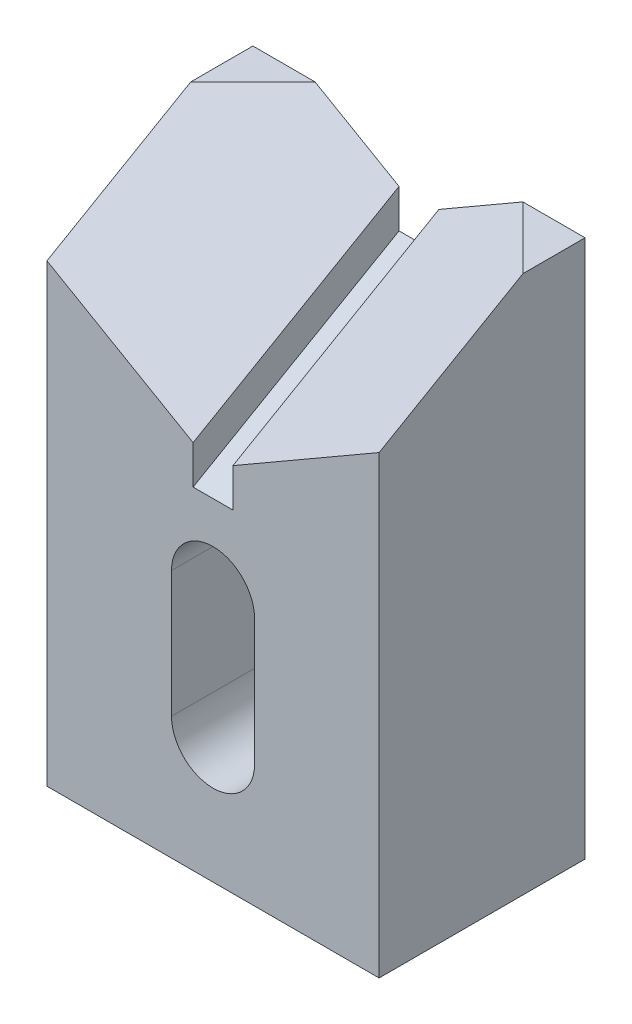
ISO-10303-21;
HEADER;
FILE_DESCRIPTION(('STEP AP214'),'2;1');
FILE_NAME('part.step','',(''),(''),'','','');
FILE_SCHEMA(('AUTOMOTIVE_DESIGN { 1 0 10303 214 1 1 1 1 }'));
ENDSEC;
DATA;
#1=APPLICATION_CONTEXT('core data for automotive mechanical design processes');
#2=APPLICATION_PROTOCOL_DEFINITION('international standard','automotive_design',2000,#1);
#3=PRODUCT_CONTEXT('',#1,'mechanical');
#4=PRODUCT('Part','Part','',(#3));
#5=PRODUCT_RELATED_PRODUCT_CATEGORY('part','',(#4));
#6=PRODUCT_DEFINITION_FORMATION('','',#4);
#7=PRODUCT_DEFINITION_CONTEXT('part definition',#1,'design');
#8=PRODUCT_DEFINITION('design','',#6,#7);
#9=PRODUCT_DEFINITION_SHAPE('','',#8);
#10=(LENGTH_UNIT() NAMED_UNIT(*) SI_UNIT(.MILLI.,.METRE.));
#11=(NAMED_UNIT(*) PLANE_ANGLE_UNIT() SI_UNIT($,.RADIAN.));
#12=(NAMED_UNIT(*) SI_UNIT($,.STERADIAN.) SOLID_ANGLE_UNIT());
#13=UNCERTAINTY_MEASURE_WITH_UNIT(LENGTH_MEASURE(1.E-05),#10,'distance_accuracy_value','');
#14=(GEOMETRIC_REPRESENTATION_CONTEXT(3) GLOBAL_UNCERTAINTY_ASSIGNED_CONTEXT((#13)) GLOBAL_UNIT_ASSIGNED_CONTEXT((#10,
#11,#12)) REPRESENTATION_CONTEXT('',''));
#15=CARTESIAN_POINT('',(0.,0.,0.));
#16=DIRECTION('',(0.,0.,1.));
#17=DIRECTION('',(1.,0.,0.));
#18=AXIS2_PLACEMENT_3D('',#15,#16,#17);
#19=CARTESIAN_POINT('',(25.4,0.,31.496));
#20=DIRECTION('',(-1.,0.,0.));
#21=DIRECTION('',(0.,-1.,0.));
#22=AXIS2_PLACEMENT_3D('',#19,#20,#21);
#23=PLANE('',#22);
#24=DIRECTION('',(0.,-0.499999999999998,0.86602540378444));
#25=VECTOR('',#24,1.);
#26=CARTESIAN_POINT('',(25.4,119.977671038215,-55.7676140084101));
#27=LINE('',#26,#25);
#28=CARTESIAN_POINT('',(25.4,82.296,9.49895474387512));
#29=VERTEX_POINT('',#28);
#30=CARTESIAN_POINT('',(25.4,69.596,31.496));
#31=VERTEX_POINT('',#30);
#32=EDGE_CURVE('E48',#29,#31,#27,.T.);
#33=ORIENTED_EDGE('',*,*,#32,.T.);
#34=DIRECTION('',(0.,1.,0.));
#35=VECTOR('',#34,1.);
#36=CARTESIAN_POINT('',(25.4,0.,31.496));
#37=LINE('',#36,#35);
#38=CARTESIAN_POINT('',(25.4,0.,31.496));
#39=VERTEX_POINT('',#38);
#40=EDGE_CURVE('E217',#39,#31,#37,.T.);
#41=ORIENTED_EDGE('',*,*,#40,.F.);
#42=DIRECTION('',(0.,0.,-1.));
#43=VECTOR('',#42,1.);
#44=CARTESIAN_POINT('',(25.4,0.,31.496));
#45=LINE('',#44,#43);
#46=CARTESIAN_POINT('',(25.4,0.,0.));
#47=VERTEX_POINT('',#46);
#48=EDGE_CURVE('E233',#39,#47,#45,.T.);
#49=ORIENTED_EDGE('',*,*,#48,.T.);
#50=DIRECTION('',(0.,1.,0.));
#51=VECTOR('',#50,1.);
#52=CARTESIAN_POINT('',(25.4,0.,0.));
#53=LINE('',#52,#51);
#54=CARTESIAN_POINT('',(25.4,82.296,0.));
#55=VERTEX_POINT('',#54);
#56=EDGE_CURVE('E225',#47,#55,#53,.T.);
#57=ORIENTED_EDGE('',*,*,#56,.T.);
#58=DIRECTION('',(0.,0.,-1.));
#59=VECTOR('',#58,1.);
#60=CARTESIAN_POINT('',(25.4,82.296,31.496));
#61=LINE('',#60,#59);
#62=EDGE_CURVE('E231',#29,#55,#61,.T.);
#63=ORIENTED_EDGE('',*,*,#62,.F.);
#64=EDGE_LOOP('',(#33,#41,#49,#57,#63));
#65=FACE_BOUND('',#64,.T.);
#66=ADVANCED_FACE('F33',(#65),#23,.F.);
#67=CARTESIAN_POINT('',(-25.4,82.296,31.496));
#68=DIRECTION('',(0.,-1.,0.));
#69=DIRECTION('',(1.,0.,0.));
#70=AXIS2_PLACEMENT_3D('',#67,#68,#69);
#71=PLANE('',#70);
#72=DIRECTION('',(-0.707106781186548,0.,-0.707106781186547));
#73=VECTOR('',#72,1.);
#74=CARTESIAN_POINT('',(10.9985226280624,82.296,-4.90252262806245));
#75=LINE('',#74,#73);
#76=CARTESIAN_POINT('',(15.9010452561248,82.296,0.));
#77=VERTEX_POINT('',#76);
#78=EDGE_CURVE('E41',#29,#77,#75,.T.);
#79=ORIENTED_EDGE('',*,*,#78,.F.);
#80=ORIENTED_EDGE('',*,*,#62,.T.);
#81=DIRECTION('',(-1.,0.,0.));
#82=VECTOR('',#81,1.);
#83=CARTESIAN_POINT('',(-25.4,82.296,0.));
#84=LINE('',#83,#82);
#85=EDGE_CURVE('E215',#55,#77,#84,.T.);
#86=ORIENTED_EDGE('',*,*,#85,.T.);
#87=EDGE_LOOP('',(#79,#80,#86));
#88=FACE_BOUND('',#87,.T.);
#89=ADVANCED_FACE('F246',(#88),#71,.F.);
#90=CARTESIAN_POINT('',(0.,0.,31.496));
#91=DIRECTION('',(0.,0.,-1.));
#92=DIRECTION('',(-1.,0.,0.));
#93=AXIS2_PLACEMENT_3D('',#90,#91,#92);
#94=PLANE('',#93);
#95=DIRECTION('',(0.,-1.,0.));
#96=VECTOR('',#95,1.);
#97=CARTESIAN_POINT('',(-3.048,56.6910667830736,31.496));
#98=LINE('',#97,#96);
#99=CARTESIAN_POINT('',(-3.048,56.6910667830736,31.496));
#100=VERTEX_POINT('',#99);
#101=CARTESIAN_POINT('',(-3.048,50.8,31.496));
#102=VERTEX_POINT('',#101);
#103=EDGE_CURVE('E161',#100,#102,#98,.T.);
#104=ORIENTED_EDGE('',*,*,#103,.F.);
#105=DIRECTION('',(0.86602540378444,-0.499999999999998,0.));
#106=VECTOR('',#105,1.);
#107=CARTESIAN_POINT('',(-25.4,69.596,31.496));
#108=LINE('',#107,#106);
#109=CARTESIAN_POINT('',(-25.4,69.596,31.496));
#110=VERTEX_POINT('',#109);
#111=EDGE_CURVE('E149',#110,#100,#108,.T.);
#112=ORIENTED_EDGE('',*,*,#111,.F.);
#113=DIRECTION('',(0.,-1.,0.));
#114=VECTOR('',#113,1.);
#115=CARTESIAN_POINT('',(-25.4,0.,31.496));
#116=LINE('',#115,#114);
#117=CARTESIAN_POINT('',(-25.4,0.,31.496));
#118=VERTEX_POINT('',#117);
#119=EDGE_CURVE('E212',#110,#118,#116,.T.);
#120=ORIENTED_EDGE('',*,*,#119,.T.);
#121=DIRECTION('',(1.,0.,0.));
#122=VECTOR('',#121,1.);
#123=CARTESIAN_POINT('',(-25.4,0.,31.496));
#124=LINE('',#123,#122);
#125=EDGE_CURVE('E214',#118,#39,#124,.T.);
#126=ORIENTED_EDGE('',*,*,#125,.T.);
#127=ORIENTED_EDGE('',*,*,#40,.T.);
#128=DIRECTION('',(-0.86602540378444,-0.499999999999998,0.));
#129=VECTOR('',#128,1.);
#130=CARTESIAN_POINT('',(25.4,69.596,31.496));
#131=LINE('',#130,#129);
#132=CARTESIAN_POINT('',(3.048,56.6910667830736,31.496));
#133=VERTEX_POINT('',#132);
#134=EDGE_CURVE('E165',#31,#133,#131,.T.);
#135=ORIENTED_EDGE('',*,*,#134,.T.);
#136=DIRECTION('',(0.,-1.,0.));
#137=VECTOR('',#136,1.);
#138=CARTESIAN_POINT('',(3.048,56.6910667830736,31.496));
#139=LINE('',#138,#137);
#140=CARTESIAN_POINT('',(3.04799999999999,50.8,31.496));
#141=VERTEX_POINT('',#140);
#142=EDGE_CURVE('E175',#133,#141,#139,.T.);
#143=ORIENTED_EDGE('',*,*,#142,.T.);
#144=DIRECTION('',(1.,0.,0.));
#145=VECTOR('',#144,1.);
#146=CARTESIAN_POINT('',(-3.048,50.8,31.496));
#147=LINE('',#146,#145);
#148=EDGE_CURVE('E158',#102,#141,#147,.T.);
#149=ORIENTED_EDGE('',*,*,#148,.F.);
#150=EDGE_LOOP('',(#104,#112,#120,#126,#127,#135,#143,#149));
#151=FACE_BOUND('',#150,.T.);
#152=CARTESIAN_POINT('',(0.,38.1,31.496));
#153=DIRECTION('',(0.,0.,1.));
#154=DIRECTION('',(1.,0.,0.));
#155=AXIS2_PLACEMENT_3D('',#152,#153,#154);
#156=CIRCLE('',#155,6.35);
#157=CARTESIAN_POINT('',(6.35,38.1,31.496));
#158=VERTEX_POINT('',#157);
#159=CARTESIAN_POINT('',(-6.35,38.1,31.496));
#160=VERTEX_POINT('',#159);
#161=EDGE_CURVE('E183',#158,#160,#156,.T.);
#162=ORIENTED_EDGE('',*,*,#161,.F.);
#163=DIRECTION('',(0.,1.,0.));
#164=VECTOR('',#163,1.);
#165=CARTESIAN_POINT('',(6.35,38.1,31.496));
#166=LINE('',#165,#164);
#167=CARTESIAN_POINT('',(6.35,18.796,31.496));
#168=VERTEX_POINT('',#167);
#169=EDGE_CURVE('E190',#168,#158,#166,.T.);
#170=ORIENTED_EDGE('',*,*,#169,.F.);
#171=CARTESIAN_POINT('',(0.,18.796,31.496));
#172=DIRECTION('',(0.,0.,1.));
#173=DIRECTION('',(1.,0.,0.));
#174=AXIS2_PLACEMENT_3D('',#171,#172,#173);
#175=CIRCLE('',#174,6.35);
#176=CARTESIAN_POINT('',(-6.34999999999999,18.796,31.496));
#177=VERTEX_POINT('',#176);
#178=EDGE_CURVE('E188',#177,#168,#175,.T.);
#179=ORIENTED_EDGE('',*,*,#178,.F.);
#180=DIRECTION('',(0.,-1.,0.));
#181=VECTOR('',#180,1.);
#182=CARTESIAN_POINT('',(-6.35,38.1,31.496));
#183=LINE('',#182,#181);
#184=EDGE_CURVE('E185',#160,#177,#183,.T.);
#185=ORIENTED_EDGE('',*,*,#184,.F.);
#186=EDGE_LOOP('',(#162,#170,#179,#185));
#187=FACE_BOUND('',#186,.T.);
#188=ADVANCED_FACE('F261',(#151,#187),#94,.F.);
#189=CARTESIAN_POINT('',(0.,0.,0.));
#190=DIRECTION('',(0.,0.,-1.));
#191=DIRECTION('',(-1.,0.,0.));
#192=AXIS2_PLACEMENT_3D('',#189,#190,#191);
#193=PLANE('',#192);
#194=DIRECTION('',(0.86602540378444,-0.499999999999998,0.));
#195=VECTOR('',#194,1.);
#196=CARTESIAN_POINT('',(-39.3419035021024,95.8295858183509,0.));
#197=LINE('',#196,#195);
#198=CARTESIAN_POINT('',(-15.9010452561249,82.296,0.));
#199=VERTEX_POINT('',#198);
#200=CARTESIAN_POINT('',(-3.048,74.8752908614699,0.));
#201=VERTEX_POINT('',#200);
#202=EDGE_CURVE('E147',#199,#201,#197,.T.);
#203=ORIENTED_EDGE('',*,*,#202,.T.);
#204=DIRECTION('',(0.,-1.,0.));
#205=VECTOR('',#204,1.);
#206=CARTESIAN_POINT('',(-3.04799999999999,107.072737821288,0.));
#207=LINE('',#206,#205);
#208=CARTESIAN_POINT('',(-3.048,68.9842240783964,0.));
#209=VERTEX_POINT('',#208);
#210=EDGE_CURVE('E134',#201,#209,#207,.T.);
#211=ORIENTED_EDGE('',*,*,#210,.T.);
#212=DIRECTION('',(1.,0.,0.));
#213=VECTOR('',#212,1.);
#214=CARTESIAN_POINT('',(-3.04800000000002,68.9842240783964,0.));
#215=LINE('',#214,#213);
#216=CARTESIAN_POINT('',(3.04799999999999,68.9842240783964,0.));
#217=VERTEX_POINT('',#216);
#218=EDGE_CURVE('E171',#209,#217,#215,.T.);
#219=ORIENTED_EDGE('',*,*,#218,.T.);
#220=DIRECTION('',(0.,-1.,0.));
#221=VECTOR('',#220,1.);
#222=CARTESIAN_POINT('',(3.04800000000004,107.072737821288,0.));
#223=LINE('',#222,#221);
#224=CARTESIAN_POINT('',(3.04799999999999,74.8752908614699,0.));
#225=VERTEX_POINT('',#224);
#226=EDGE_CURVE('E169',#225,#217,#223,.T.);
#227=ORIENTED_EDGE('',*,*,#226,.F.);
#228=DIRECTION('',(-0.86602540378444,-0.499999999999998,0.));
#229=VECTOR('',#228,1.);
#230=CARTESIAN_POINT('',(39.3419035021024,95.8295858183509,0.));
#231=LINE('',#230,#229);
#232=EDGE_CURVE('E167',#77,#225,#231,.T.);
#233=ORIENTED_EDGE('',*,*,#232,.F.);
#234=ORIENTED_EDGE('',*,*,#85,.F.);
#235=ORIENTED_EDGE('',*,*,#56,.F.);
#236=DIRECTION('',(1.,0.,0.));
#237=VECTOR('',#236,1.);
#238=CARTESIAN_POINT('',(-25.4,0.,0.));
#239=LINE('',#238,#237);
#240=CARTESIAN_POINT('',(-25.4,0.,0.));
#241=VERTEX_POINT('',#240);
#242=EDGE_CURVE('E223',#241,#47,#239,.T.);
#243=ORIENTED_EDGE('',*,*,#242,.F.);
#244=DIRECTION('',(0.,-1.,0.));
#245=VECTOR('',#244,1.);
#246=CARTESIAN_POINT('',(-25.4,0.,0.));
#247=LINE('',#246,#245);
#248=CARTESIAN_POINT('',(-25.4,82.296,0.));
#249=VERTEX_POINT('',#248);
#250=EDGE_CURVE('E211',#249,#241,#247,.T.);
#251=ORIENTED_EDGE('',*,*,#250,.F.);
#252=EDGE_CURVE('E157',#199,#249,#84,.T.);
#253=ORIENTED_EDGE('',*,*,#252,.F.);
#254=EDGE_LOOP('',(#203,#211,#219,#227,#233,#234,#235,#243,#251,#253));
#255=FACE_BOUND('',#254,.T.);
#256=DIRECTION('',(0.,1.,0.));
#257=VECTOR('',#256,1.);
#258=CARTESIAN_POINT('',(6.35,38.1,0.));
#259=LINE('',#258,#257);
#260=CARTESIAN_POINT('',(6.35,18.796,0.));
#261=VERTEX_POINT('',#260);
#262=CARTESIAN_POINT('',(6.35,38.1,0.));
#263=VERTEX_POINT('',#262);
#264=EDGE_CURVE('E186',#261,#263,#259,.T.);
#265=ORIENTED_EDGE('',*,*,#264,.T.);
#266=CARTESIAN_POINT('',(0.,38.1,0.));
#267=DIRECTION('',(0.,0.,1.));
#268=DIRECTION('',(1.,0.,0.));
#269=AXIS2_PLACEMENT_3D('',#266,#267,#268);
#270=CIRCLE('',#269,6.35);
#271=CARTESIAN_POINT('',(-6.35,38.1,0.));
#272=VERTEX_POINT('',#271);
#273=EDGE_CURVE('E182',#263,#272,#270,.T.);
#274=ORIENTED_EDGE('',*,*,#273,.T.);
#275=DIRECTION('',(0.,-1.,0.));
#276=VECTOR('',#275,1.);
#277=CARTESIAN_POINT('',(-6.35,38.1,0.));
#278=LINE('',#277,#276);
#279=CARTESIAN_POINT('',(-6.34999999999999,18.796,0.));
#280=VERTEX_POINT('',#279);
#281=EDGE_CURVE('E195',#272,#280,#278,.T.);
#282=ORIENTED_EDGE('',*,*,#281,.T.);
#283=CARTESIAN_POINT('',(0.,18.796,0.));
#284=DIRECTION('',(0.,0.,1.));
#285=DIRECTION('',(1.,0.,0.));
#286=AXIS2_PLACEMENT_3D('',#283,#284,#285);
#287=CIRCLE('',#286,6.35);
#288=EDGE_CURVE('E198',#280,#261,#287,.T.);
#289=ORIENTED_EDGE('',*,*,#288,.T.);
#290=EDGE_LOOP('',(#265,#274,#282,#289));
#291=FACE_BOUND('',#290,.T.);
#292=ADVANCED_FACE('F153',(#255,#291),#193,.T.);
#293=CARTESIAN_POINT('',(-25.4,0.,31.496));
#294=DIRECTION('',(1.,0.,0.));
#295=DIRECTION('',(0.,0.,-1.));
#296=AXIS2_PLACEMENT_3D('',#293,#294,#295);
#297=PLANE('',#296);
#298=ORIENTED_EDGE('',*,*,#119,.F.);
#299=DIRECTION('',(0.,-0.499999999999998,0.86602540378444));
#300=VECTOR('',#299,1.);
#301=CARTESIAN_POINT('',(-25.4,119.977671038215,-55.7676140084101));
#302=LINE('',#301,#300);
#303=CARTESIAN_POINT('',(-25.4,82.296,9.49895474387512));
#304=VERTEX_POINT('',#303);
#305=EDGE_CURVE('E180',#304,#110,#302,.T.);
#306=ORIENTED_EDGE('',*,*,#305,.F.);
#307=DIRECTION('',(0.,0.,-1.));
#308=VECTOR('',#307,1.);
#309=CARTESIAN_POINT('',(-25.4,82.296,31.496));
#310=LINE('',#309,#308);
#311=EDGE_CURVE('E220',#304,#249,#310,.T.);
#312=ORIENTED_EDGE('',*,*,#311,.T.);
#313=ORIENTED_EDGE('',*,*,#250,.T.);
#314=DIRECTION('',(0.,0.,-1.));
#315=VECTOR('',#314,1.);
#316=CARTESIAN_POINT('',(-25.4,0.,31.496));
#317=LINE('',#316,#315);
#318=EDGE_CURVE('E236',#118,#241,#317,.T.);
#319=ORIENTED_EDGE('',*,*,#318,.F.);
#320=EDGE_LOOP('',(#298,#306,#312,#313,#319));
#321=FACE_BOUND('',#320,.T.);
#322=ADVANCED_FACE('F35',(#321),#297,.F.);
#323=CARTESIAN_POINT('',(-25.4,0.,31.496));
#324=DIRECTION('',(0.,1.,0.));
#325=DIRECTION('',(-1.,0.,0.));
#326=AXIS2_PLACEMENT_3D('',#323,#324,#325);
#327=PLANE('',#326);
#328=ORIENTED_EDGE('',*,*,#242,.T.);
#329=ORIENTED_EDGE('',*,*,#48,.F.);
#330=ORIENTED_EDGE('',*,*,#125,.F.);
#331=ORIENTED_EDGE('',*,*,#318,.T.);
#332=EDGE_LOOP('',(#328,#329,#330,#331));
#333=FACE_BOUND('',#332,.T.);
#334=ADVANCED_FACE('F253',(#333),#327,.F.);
#335=ORIENTED_EDGE('',*,*,#311,.F.);
#336=DIRECTION('',(0.707106781186548,0.,-0.707106781186547));
#337=VECTOR('',#336,1.);
#338=CARTESIAN_POINT('',(-36.3985226280624,82.296,20.4974773719376));
#339=LINE('',#338,#337);
#340=EDGE_CURVE('E11',#304,#199,#339,.T.);
#341=ORIENTED_EDGE('',*,*,#340,.T.);
#342=ORIENTED_EDGE('',*,*,#252,.T.);
#343=EDGE_LOOP('',(#335,#341,#342));
#344=FACE_BOUND('',#343,.T.);
#345=ADVANCED_FACE('F259',(#344),#71,.F.);
#346=CARTESIAN_POINT('',(0.,38.1,31.496));
#347=DIRECTION('',(0.,0.,-1.));
#348=DIRECTION('',(-1.,0.,0.));
#349=AXIS2_PLACEMENT_3D('',#346,#347,#348);
#350=CYLINDRICAL_SURFACE('',#349,6.35);
#351=ORIENTED_EDGE('',*,*,#273,.F.);
#352=DIRECTION('',(0.,0.,-1.));
#353=VECTOR('',#352,1.);
#354=CARTESIAN_POINT('',(6.35,38.1,31.496));
#355=LINE('',#354,#353);
#356=EDGE_CURVE('E192',#158,#263,#355,.T.);
#357=ORIENTED_EDGE('',*,*,#356,.F.);
#358=ORIENTED_EDGE('',*,*,#161,.T.);
#359=DIRECTION('',(0.,0.,-1.));
#360=VECTOR('',#359,1.);
#361=CARTESIAN_POINT('',(-6.35,38.1,31.496));
#362=LINE('',#361,#360);
#363=EDGE_CURVE('E208',#160,#272,#362,.T.);
#364=ORIENTED_EDGE('',*,*,#363,.T.);
#365=EDGE_LOOP('',(#351,#357,#358,#364));
#366=FACE_BOUND('',#365,.T.);
#367=ADVANCED_FACE('F294',(#366),#350,.F.);
#368=CARTESIAN_POINT('',(-6.35,38.1,31.496));
#369=DIRECTION('',(1.,0.,0.));
#370=DIRECTION('',(0.,1.,0.));
#371=AXIS2_PLACEMENT_3D('',#368,#369,#370);
#372=PLANE('',#371);
#373=ORIENTED_EDGE('',*,*,#281,.F.);
#374=ORIENTED_EDGE('',*,*,#363,.F.);
#375=ORIENTED_EDGE('',*,*,#184,.T.);
#376=DIRECTION('',(0.,0.,-1.));
#377=VECTOR('',#376,1.);
#378=CARTESIAN_POINT('',(-6.34999999999999,18.796,31.496));
#379=LINE('',#378,#377);
#380=EDGE_CURVE('E206',#177,#280,#379,.T.);
#381=ORIENTED_EDGE('',*,*,#380,.T.);
#382=EDGE_LOOP('',(#373,#374,#375,#381));
#383=FACE_BOUND('',#382,.T.);
#384=ADVANCED_FACE('F305',(#383),#372,.T.);
#385=CARTESIAN_POINT('',(0.,18.796,31.496));
#386=DIRECTION('',(0.,0.,-1.));
#387=DIRECTION('',(-1.,0.,0.));
#388=AXIS2_PLACEMENT_3D('',#385,#386,#387);
#389=CYLINDRICAL_SURFACE('',#388,6.35);
#390=ORIENTED_EDGE('',*,*,#288,.F.);
#391=ORIENTED_EDGE('',*,*,#380,.F.);
#392=ORIENTED_EDGE('',*,*,#178,.T.);
#393=DIRECTION('',(0.,0.,-1.));
#394=VECTOR('',#393,1.);
#395=CARTESIAN_POINT('',(6.35,18.796,31.496));
#396=LINE('',#395,#394);
#397=EDGE_CURVE('E56',#168,#261,#396,.T.);
#398=ORIENTED_EDGE('',*,*,#397,.T.);
#399=EDGE_LOOP('',(#390,#391,#392,#398));
#400=FACE_BOUND('',#399,.T.);
#401=ADVANCED_FACE('F309',(#400),#389,.F.);
#402=CARTESIAN_POINT('',(6.35,38.1,31.496));
#403=DIRECTION('',(-1.,0.,0.));
#404=DIRECTION('',(0.,-1.,0.));
#405=AXIS2_PLACEMENT_3D('',#402,#403,#404);
#406=PLANE('',#405);
#407=ORIENTED_EDGE('',*,*,#264,.F.);
#408=ORIENTED_EDGE('',*,*,#397,.F.);
#409=ORIENTED_EDGE('',*,*,#169,.T.);
#410=ORIENTED_EDGE('',*,*,#356,.T.);
#411=EDGE_LOOP('',(#407,#408,#409,#410));
#412=FACE_BOUND('',#411,.T.);
#413=ADVANCED_FACE('F313',(#412),#406,.T.);
#414=CARTESIAN_POINT('',(-25.4,119.977671038215,-55.7676140084101));
#415=DIRECTION('',(-0.447213595499956,-0.774596669241485,-0.447213595499957));
#416=DIRECTION('',(0.,0.499999999999998,-0.86602540378444));
#417=AXIS2_PLACEMENT_3D('',#414,#415,#416);
#418=PLANE('',#417);
#419=ORIENTED_EDGE('',*,*,#305,.T.);
#420=ORIENTED_EDGE('',*,*,#111,.T.);
#421=DIRECTION('',(0.,-0.499999999999998,0.86602540378444));
#422=VECTOR('',#421,1.);
#423=CARTESIAN_POINT('',(-3.04800000000001,107.072737821288,-55.7676140084101));
#424=LINE('',#423,#422);
#425=EDGE_CURVE('E138',#201,#100,#424,.T.);
#426=ORIENTED_EDGE('',*,*,#425,.F.);
#427=ORIENTED_EDGE('',*,*,#202,.F.);
#428=ORIENTED_EDGE('',*,*,#340,.F.);
#429=EDGE_LOOP('',(#419,#420,#426,#427,#428));
#430=FACE_BOUND('',#429,.T.);
#431=ADVANCED_FACE('F146',(#430),#418,.F.);
#432=CARTESIAN_POINT('',(25.4,119.977671038215,-55.7676140084101));
#433=DIRECTION('',(-0.447213595499956,0.774596669241485,0.447213595499957));
#434=DIRECTION('',(0.,-0.499999999999998,0.86602540378444));
#435=AXIS2_PLACEMENT_3D('',#432,#433,#434);
#436=PLANE('',#435);
#437=ORIENTED_EDGE('',*,*,#78,.T.);
#438=ORIENTED_EDGE('',*,*,#232,.T.);
#439=DIRECTION('',(0.,-0.499999999999998,0.86602540378444));
#440=VECTOR('',#439,1.);
#441=CARTESIAN_POINT('',(3.04799999999998,107.072737821288,-55.7676140084101));
#442=LINE('',#441,#440);
#443=EDGE_CURVE('E176',#225,#133,#442,.T.);
#444=ORIENTED_EDGE('',*,*,#443,.T.);
#445=ORIENTED_EDGE('',*,*,#134,.F.);
#446=ORIENTED_EDGE('',*,*,#32,.F.);
#447=EDGE_LOOP('',(#437,#438,#444,#445,#446));
#448=FACE_BOUND('',#447,.T.);
#449=ADVANCED_FACE('F239',(#448),#436,.T.);
#450=CARTESIAN_POINT('',(-3.04800000000001,107.072737821288,-55.7676140084101));
#451=DIRECTION('',(-1.,0.,0.));
#452=DIRECTION('',(0.,0.,1.));
#453=AXIS2_PLACEMENT_3D('',#450,#451,#452);
#454=PLANE('',#453);
#455=ORIENTED_EDGE('',*,*,#425,.T.);
#456=ORIENTED_EDGE('',*,*,#103,.T.);
#457=DIRECTION('',(0.,-0.499999999999998,0.86602540378444));
#458=VECTOR('',#457,1.);
#459=CARTESIAN_POINT('',(-3.04800000000002,101.181671038215,-55.7676140084101));
#460=LINE('',#459,#458);
#461=EDGE_CURVE('E140',#209,#102,#460,.T.);
#462=ORIENTED_EDGE('',*,*,#461,.F.);
#463=ORIENTED_EDGE('',*,*,#210,.F.);
#464=EDGE_LOOP('',(#455,#456,#462,#463));
#465=FACE_BOUND('',#464,.T.);
#466=ADVANCED_FACE('F136',(#465),#454,.F.);
#467=CARTESIAN_POINT('',(-3.04800000000002,101.181671038215,-55.7676140084101));
#468=DIRECTION('',(0.,-0.86602540378444,-0.499999999999998));
#469=DIRECTION('',(0.,0.499999999999998,-0.86602540378444));
#470=AXIS2_PLACEMENT_3D('',#467,#468,#469);
#471=PLANE('',#470);
#472=ORIENTED_EDGE('',*,*,#461,.T.);
#473=ORIENTED_EDGE('',*,*,#148,.T.);
#474=DIRECTION('',(0.,-0.499999999999998,0.86602540378444));
#475=VECTOR('',#474,1.);
#476=CARTESIAN_POINT('',(3.04799999999997,101.181671038215,-55.7676140084101));
#477=LINE('',#476,#475);
#478=EDGE_CURVE('E172',#217,#141,#477,.T.);
#479=ORIENTED_EDGE('',*,*,#478,.F.);
#480=ORIENTED_EDGE('',*,*,#218,.F.);
#481=EDGE_LOOP('',(#472,#473,#479,#480));
#482=FACE_BOUND('',#481,.T.);
#483=ADVANCED_FACE('F273',(#482),#471,.F.);
#484=CARTESIAN_POINT('',(3.04799999999998,107.072737821288,-55.7676140084101));
#485=DIRECTION('',(-1.,0.,0.));
#486=DIRECTION('',(0.,-1.,0.));
#487=AXIS2_PLACEMENT_3D('',#484,#485,#486);
#488=PLANE('',#487);
#489=ORIENTED_EDGE('',*,*,#226,.T.);
#490=ORIENTED_EDGE('',*,*,#478,.T.);
#491=ORIENTED_EDGE('',*,*,#142,.F.);
#492=ORIENTED_EDGE('',*,*,#443,.F.);
#493=EDGE_LOOP('',(#489,#490,#491,#492));
#494=FACE_BOUND('',#493,.T.);
#495=ADVANCED_FACE('F270',(#494),#488,.T.);
#496=CLOSED_SHELL('',(#66,#89,#188,#292,#322,#334,#345,#367,#384,#401,#413,#431,#449,#466,#483,#495));
#497=MANIFOLD_SOLID_BREP('B2',#496);
#498=ADVANCED_BREP_SHAPE_REPRESENTATION('',(#18,#497),#14);
#499=SHAPE_DEFINITION_REPRESENTATION(#9,#498);
ENDSEC;
END-ISO-10303-21;
